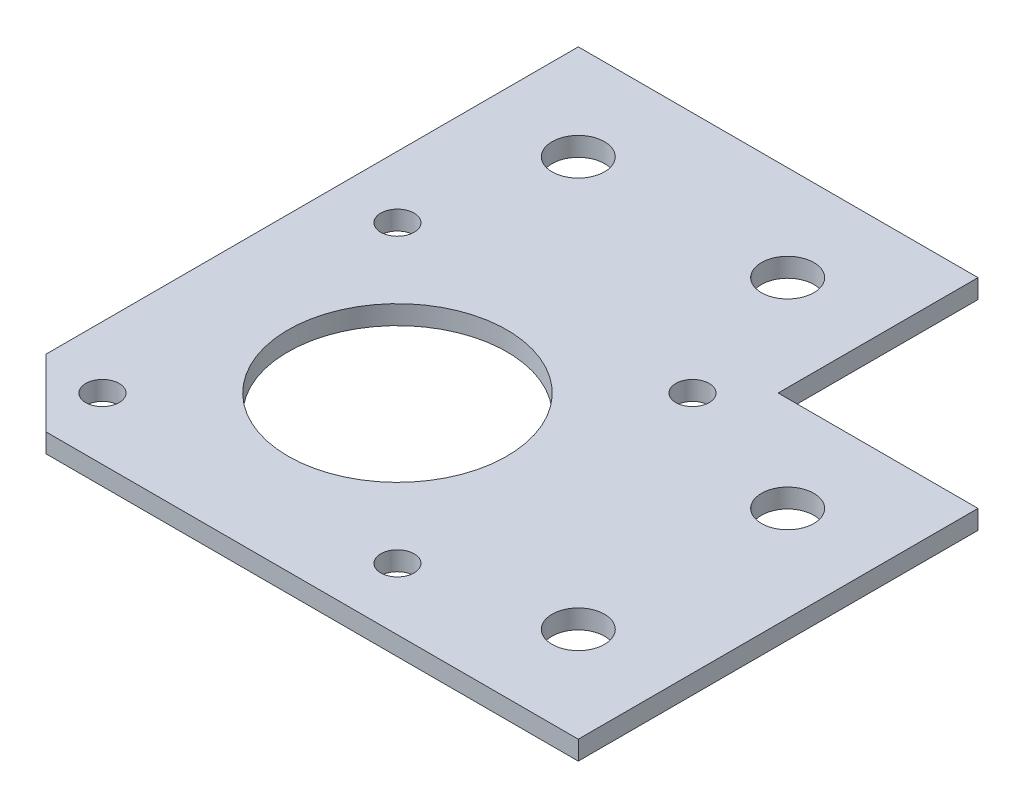
ISO-10303-21;
HEADER;
FILE_DESCRIPTION(('STEP AP214'),'2;1');
FILE_NAME('part.step','',(''),(''),'','','');
FILE_SCHEMA(('AUTOMOTIVE_DESIGN { 1 0 10303 214 1 1 1 1 }'));
ENDSEC;
DATA;
#1=APPLICATION_CONTEXT('core data for automotive mechanical design processes');
#2=APPLICATION_PROTOCOL_DEFINITION('international standard','automotive_design',2000,#1);
#3=PRODUCT_CONTEXT('',#1,'mechanical');
#4=PRODUCT('Part','Part','',(#3));
#5=PRODUCT_RELATED_PRODUCT_CATEGORY('part','',(#4));
#6=PRODUCT_DEFINITION_FORMATION('','',#4);
#7=PRODUCT_DEFINITION_CONTEXT('part definition',#1,'design');
#8=PRODUCT_DEFINITION('design','',#6,#7);
#9=PRODUCT_DEFINITION_SHAPE('','',#8);
#10=(LENGTH_UNIT() NAMED_UNIT(*) SI_UNIT(.MILLI.,.METRE.));
#11=(NAMED_UNIT(*) PLANE_ANGLE_UNIT() SI_UNIT($,.RADIAN.));
#12=(NAMED_UNIT(*) SI_UNIT($,.STERADIAN.) SOLID_ANGLE_UNIT());
#13=UNCERTAINTY_MEASURE_WITH_UNIT(LENGTH_MEASURE(1.E-05),#10,'distance_accuracy_value','');
#14=(GEOMETRIC_REPRESENTATION_CONTEXT(3) GLOBAL_UNCERTAINTY_ASSIGNED_CONTEXT((#13)) GLOBAL_UNIT_ASSIGNED_CONTEXT((#10,
#11,#12)) REPRESENTATION_CONTEXT('',''));
#15=CARTESIAN_POINT('',(0.,0.,0.));
#16=DIRECTION('',(0.,0.,1.));
#17=DIRECTION('',(1.,0.,0.));
#18=AXIS2_PLACEMENT_3D('',#15,#16,#17);
#19=CARTESIAN_POINT('',(-63.,2.,0.));
#20=DIRECTION('',(0.,0.,1.));
#21=DIRECTION('',(1.,0.,0.));
#22=AXIS2_PLACEMENT_3D('',#19,#20,#21);
#23=PLANE('',#22);
#24=DIRECTION('',(-1.,0.,0.));
#25=VECTOR('',#24,1.);
#26=CARTESIAN_POINT('',(-63.,0.,0.));
#27=LINE('',#26,#25);
#28=CARTESIAN_POINT('',(-21.,0.,0.));
#29=VERTEX_POINT('',#28);
#30=CARTESIAN_POINT('',(-63.,0.,0.));
#31=VERTEX_POINT('',#30);
#32=EDGE_CURVE('E125',#29,#31,#27,.T.);
#33=ORIENTED_EDGE('',*,*,#32,.T.);
#34=DIRECTION('',(0.,-1.,0.));
#35=VECTOR('',#34,1.);
#36=CARTESIAN_POINT('',(-63.,2.,0.));
#37=LINE('',#36,#35);
#38=CARTESIAN_POINT('',(-63.,2.,0.));
#39=VERTEX_POINT('',#38);
#40=EDGE_CURVE('E11',#39,#31,#37,.T.);
#41=ORIENTED_EDGE('',*,*,#40,.F.);
#42=DIRECTION('',(-1.,0.,0.));
#43=VECTOR('',#42,1.);
#44=CARTESIAN_POINT('',(-63.,2.,0.));
#45=LINE('',#44,#43);
#46=CARTESIAN_POINT('',(-21.,2.,0.));
#47=VERTEX_POINT('',#46);
#48=EDGE_CURVE('E138',#47,#39,#45,.T.);
#49=ORIENTED_EDGE('',*,*,#48,.F.);
#50=DIRECTION('',(0.,-1.,0.));
#51=VECTOR('',#50,1.);
#52=CARTESIAN_POINT('',(-21.,2.,0.));
#53=LINE('',#52,#51);
#54=EDGE_CURVE('E121',#47,#29,#53,.T.);
#55=ORIENTED_EDGE('',*,*,#54,.T.);
#56=EDGE_LOOP('',(#33,#41,#49,#55));
#57=FACE_BOUND('',#56,.T.);
#58=ADVANCED_FACE('F35',(#57),#23,.F.);
#59=CARTESIAN_POINT('',(-63.,2.,0.));
#60=DIRECTION('',(1.,0.,0.));
#61=DIRECTION('',(0.,0.,-1.));
#62=AXIS2_PLACEMENT_3D('',#59,#60,#61);
#63=PLANE('',#62);
#64=DIRECTION('',(0.,0.,1.));
#65=VECTOR('',#64,1.);
#66=CARTESIAN_POINT('',(-63.,0.,0.));
#67=LINE('',#66,#65);
#68=CARTESIAN_POINT('',(-63.,0.,55.9289321881345));
#69=VERTEX_POINT('',#68);
#70=EDGE_CURVE('E128',#31,#69,#67,.T.);
#71=ORIENTED_EDGE('',*,*,#70,.T.);
#72=DIRECTION('',(0.,1.,0.));
#73=VECTOR('',#72,1.);
#74=CARTESIAN_POINT('',(-63.,0.,55.9289321881345));
#75=LINE('',#74,#73);
#76=CARTESIAN_POINT('',(-63.,2.,55.9289321881345));
#77=VERTEX_POINT('',#76);
#78=EDGE_CURVE('E49',#69,#77,#75,.T.);
#79=ORIENTED_EDGE('',*,*,#78,.T.);
#80=DIRECTION('',(0.,0.,1.));
#81=VECTOR('',#80,1.);
#82=CARTESIAN_POINT('',(-63.,2.,0.));
#83=LINE('',#82,#81);
#84=EDGE_CURVE('E89',#39,#77,#83,.T.);
#85=ORIENTED_EDGE('',*,*,#84,.F.);
#86=ORIENTED_EDGE('',*,*,#40,.T.);
#87=EDGE_LOOP('',(#71,#79,#85,#86));
#88=FACE_BOUND('',#87,.T.);
#89=ADVANCED_FACE('F254',(#88),#63,.F.);
#90=CARTESIAN_POINT('',(-63.,2.,63.));
#91=DIRECTION('',(0.,0.,-1.));
#92=DIRECTION('',(-1.,0.,0.));
#93=AXIS2_PLACEMENT_3D('',#90,#91,#92);
#94=PLANE('',#93);
#95=DIRECTION('',(1.,0.,0.));
#96=VECTOR('',#95,1.);
#97=CARTESIAN_POINT('',(-63.,2.,63.));
#98=LINE('',#97,#96);
#99=CARTESIAN_POINT('',(-55.9289321881345,2.,63.));
#100=VERTEX_POINT('',#99);
#101=CARTESIAN_POINT('',(0.,2.,63.));
#102=VERTEX_POINT('',#101);
#103=EDGE_CURVE('E105',#100,#102,#98,.T.);
#104=ORIENTED_EDGE('',*,*,#103,.F.);
#105=DIRECTION('',(0.,1.,0.));
#106=VECTOR('',#105,1.);
#107=CARTESIAN_POINT('',(-55.9289321881345,0.,63.));
#108=LINE('',#107,#106);
#109=CARTESIAN_POINT('',(-55.9289321881345,0.,63.));
#110=VERTEX_POINT('',#109);
#111=EDGE_CURVE('E173',#110,#100,#108,.T.);
#112=ORIENTED_EDGE('',*,*,#111,.F.);
#113=DIRECTION('',(1.,0.,0.));
#114=VECTOR('',#113,1.);
#115=CARTESIAN_POINT('',(-63.,0.,63.));
#116=LINE('',#115,#114);
#117=CARTESIAN_POINT('',(0.,0.,63.));
#118=VERTEX_POINT('',#117);
#119=EDGE_CURVE('E132',#110,#118,#116,.T.);
#120=ORIENTED_EDGE('',*,*,#119,.T.);
#121=DIRECTION('',(0.,-1.,0.));
#122=VECTOR('',#121,1.);
#123=CARTESIAN_POINT('',(0.,2.,63.));
#124=LINE('',#123,#122);
#125=EDGE_CURVE('E42',#102,#118,#124,.T.);
#126=ORIENTED_EDGE('',*,*,#125,.F.);
#127=EDGE_LOOP('',(#104,#112,#120,#126));
#128=FACE_BOUND('',#127,.T.);
#129=ADVANCED_FACE('F258',(#128),#94,.F.);
#130=CARTESIAN_POINT('',(0.,2.,63.));
#131=DIRECTION('',(-1.,0.,0.));
#132=DIRECTION('',(0.,0.,1.));
#133=AXIS2_PLACEMENT_3D('',#130,#131,#132);
#134=PLANE('',#133);
#135=DIRECTION('',(0.,0.,-1.));
#136=VECTOR('',#135,1.);
#137=CARTESIAN_POINT('',(0.,0.,63.));
#138=LINE('',#137,#136);
#139=CARTESIAN_POINT('',(0.,0.,21.));
#140=VERTEX_POINT('',#139);
#141=EDGE_CURVE('E114',#118,#140,#138,.T.);
#142=ORIENTED_EDGE('',*,*,#141,.T.);
#143=DIRECTION('',(0.,-1.,0.));
#144=VECTOR('',#143,1.);
#145=CARTESIAN_POINT('',(0.,2.,21.));
#146=LINE('',#145,#144);
#147=CARTESIAN_POINT('',(0.,2.,21.));
#148=VERTEX_POINT('',#147);
#149=EDGE_CURVE('E111',#148,#140,#146,.T.);
#150=ORIENTED_EDGE('',*,*,#149,.F.);
#151=DIRECTION('',(0.,0.,-1.));
#152=VECTOR('',#151,1.);
#153=CARTESIAN_POINT('',(0.,2.,63.));
#154=LINE('',#153,#152);
#155=EDGE_CURVE('E97',#102,#148,#154,.T.);
#156=ORIENTED_EDGE('',*,*,#155,.F.);
#157=ORIENTED_EDGE('',*,*,#125,.T.);
#158=EDGE_LOOP('',(#142,#150,#156,#157));
#159=FACE_BOUND('',#158,.T.);
#160=ADVANCED_FACE('F112',(#159),#134,.F.);
#161=CARTESIAN_POINT('',(-21.,2.,21.));
#162=DIRECTION('',(0.,0.,1.));
#163=DIRECTION('',(1.,0.,0.));
#164=AXIS2_PLACEMENT_3D('',#161,#162,#163);
#165=PLANE('',#164);
#166=DIRECTION('',(-1.,0.,0.));
#167=VECTOR('',#166,1.);
#168=CARTESIAN_POINT('',(-21.,0.,21.));
#169=LINE('',#168,#167);
#170=CARTESIAN_POINT('',(-21.,0.,21.));
#171=VERTEX_POINT('',#170);
#172=EDGE_CURVE('E135',#140,#171,#169,.T.);
#173=ORIENTED_EDGE('',*,*,#172,.T.);
#174=DIRECTION('',(0.,-1.,0.));
#175=VECTOR('',#174,1.);
#176=CARTESIAN_POINT('',(-21.,2.,21.));
#177=LINE('',#176,#175);
#178=CARTESIAN_POINT('',(-21.,2.,21.));
#179=VERTEX_POINT('',#178);
#180=EDGE_CURVE('E117',#179,#171,#177,.T.);
#181=ORIENTED_EDGE('',*,*,#180,.F.);
#182=DIRECTION('',(-1.,0.,0.));
#183=VECTOR('',#182,1.);
#184=CARTESIAN_POINT('',(-21.,2.,21.));
#185=LINE('',#184,#183);
#186=EDGE_CURVE('E101',#148,#179,#185,.T.);
#187=ORIENTED_EDGE('',*,*,#186,.F.);
#188=ORIENTED_EDGE('',*,*,#149,.T.);
#189=EDGE_LOOP('',(#173,#181,#187,#188));
#190=FACE_BOUND('',#189,.T.);
#191=ADVANCED_FACE('F119',(#190),#165,.F.);
#192=CARTESIAN_POINT('',(-21.,2.,0.));
#193=DIRECTION('',(-1.,0.,0.));
#194=DIRECTION('',(0.,0.,1.));
#195=AXIS2_PLACEMENT_3D('',#192,#193,#194);
#196=PLANE('',#195);
#197=DIRECTION('',(0.,0.,-1.));
#198=VECTOR('',#197,1.);
#199=CARTESIAN_POINT('',(-21.,0.,0.));
#200=LINE('',#199,#198);
#201=EDGE_CURVE('E82',#171,#29,#200,.T.);
#202=ORIENTED_EDGE('',*,*,#201,.T.);
#203=ORIENTED_EDGE('',*,*,#54,.F.);
#204=DIRECTION('',(0.,0.,-1.));
#205=VECTOR('',#204,1.);
#206=CARTESIAN_POINT('',(-21.,2.,0.));
#207=LINE('',#206,#205);
#208=EDGE_CURVE('E58',#179,#47,#207,.T.);
#209=ORIENTED_EDGE('',*,*,#208,.F.);
#210=ORIENTED_EDGE('',*,*,#180,.T.);
#211=EDGE_LOOP('',(#202,#203,#209,#210));
#212=FACE_BOUND('',#211,.T.);
#213=ADVANCED_FACE('F146',(#212),#196,.F.);
#214=CARTESIAN_POINT('',(0.,2.,0.));
#215=DIRECTION('',(0.,-1.,0.));
#216=DIRECTION('',(0.,0.,-1.));
#217=AXIS2_PLACEMENT_3D('',#214,#215,#216);
#218=PLANE('',#217);
#219=CARTESIAN_POINT('',(-31.,2.,10.));
#220=DIRECTION('',(0.,1.,0.));
#221=DIRECTION('',(0.,0.,1.));
#222=AXIS2_PLACEMENT_3D('',#219,#220,#221);
#223=CIRCLE('',#222,2.75);
#224=CARTESIAN_POINT('',(-31.,2.,12.75));
#225=VERTEX_POINT('',#224);
#226=EDGE_CURVE('E159',#225,#225,#223,.T.);
#227=ORIENTED_EDGE('',*,*,#226,.F.);
#228=EDGE_LOOP('',(#227));
#229=FACE_BOUND('',#228,.T.);
#230=CARTESIAN_POINT('',(-9.99999999999999,2.,53.));
#231=DIRECTION('',(0.,1.,0.));
#232=DIRECTION('',(0.,0.,1.));
#233=AXIS2_PLACEMENT_3D('',#230,#231,#232);
#234=CIRCLE('',#233,2.75);
#235=CARTESIAN_POINT('',(-9.99999999999999,2.,55.75));
#236=VERTEX_POINT('',#235);
#237=EDGE_CURVE('E187',#236,#236,#234,.T.);
#238=ORIENTED_EDGE('',*,*,#237,.F.);
#239=EDGE_LOOP('',(#238));
#240=FACE_BOUND('',#239,.T.);
#241=CARTESIAN_POINT('',(-10.,2.,31.));
#242=DIRECTION('',(0.,1.,0.));
#243=DIRECTION('',(0.,0.,1.));
#244=AXIS2_PLACEMENT_3D('',#241,#242,#243);
#245=CIRCLE('',#244,2.75);
#246=CARTESIAN_POINT('',(-10.,2.,33.75));
#247=VERTEX_POINT('',#246);
#248=EDGE_CURVE('E172',#247,#247,#245,.T.);
#249=ORIENTED_EDGE('',*,*,#248,.F.);
#250=EDGE_LOOP('',(#249));
#251=FACE_BOUND('',#250,.T.);
#252=CARTESIAN_POINT('',(-56.5,2.,56.5));
#253=DIRECTION('',(0.,1.,0.));
#254=DIRECTION('',(0.,0.,1.));
#255=AXIS2_PLACEMENT_3D('',#252,#253,#254);
#256=CIRCLE('',#255,1.75);
#257=CARTESIAN_POINT('',(-56.5,2.,58.25));
#258=VERTEX_POINT('',#257);
#259=EDGE_CURVE('E166',#258,#258,#256,.T.);
#260=ORIENTED_EDGE('',*,*,#259,.F.);
#261=EDGE_LOOP('',(#260));
#262=FACE_BOUND('',#261,.T.);
#263=CARTESIAN_POINT('',(-25.5,2.,56.5));
#264=DIRECTION('',(0.,1.,0.));
#265=DIRECTION('',(0.,0.,1.));
#266=AXIS2_PLACEMENT_3D('',#263,#264,#265);
#267=CIRCLE('',#266,1.75);
#268=CARTESIAN_POINT('',(-25.5,2.,58.25));
#269=VERTEX_POINT('',#268);
#270=EDGE_CURVE('E209',#269,#269,#267,.T.);
#271=ORIENTED_EDGE('',*,*,#270,.F.);
#272=EDGE_LOOP('',(#271));
#273=FACE_BOUND('',#272,.T.);
#274=CARTESIAN_POINT('',(-25.5000000000001,2.,25.5));
#275=DIRECTION('',(0.,1.,0.));
#276=DIRECTION('',(0.,0.,1.));
#277=AXIS2_PLACEMENT_3D('',#274,#275,#276);
#278=CIRCLE('',#277,1.75);
#279=CARTESIAN_POINT('',(-25.5000000000001,2.,27.25));
#280=VERTEX_POINT('',#279);
#281=EDGE_CURVE('E203',#280,#280,#278,.T.);
#282=ORIENTED_EDGE('',*,*,#281,.F.);
#283=EDGE_LOOP('',(#282));
#284=FACE_BOUND('',#283,.T.);
#285=CARTESIAN_POINT('',(-56.5000000000001,2.,25.5));
#286=DIRECTION('',(0.,1.,0.));
#287=DIRECTION('',(0.,0.,1.));
#288=AXIS2_PLACEMENT_3D('',#285,#286,#287);
#289=CIRCLE('',#288,1.75);
#290=CARTESIAN_POINT('',(-56.5000000000001,2.,27.25));
#291=VERTEX_POINT('',#290);
#292=EDGE_CURVE('E197',#291,#291,#289,.T.);
#293=ORIENTED_EDGE('',*,*,#292,.F.);
#294=EDGE_LOOP('',(#293));
#295=FACE_BOUND('',#294,.T.);
#296=CARTESIAN_POINT('',(-41.,2.,41.));
#297=DIRECTION('',(0.,1.,0.));
#298=DIRECTION('',(0.,0.,1.));
#299=AXIS2_PLACEMENT_3D('',#296,#297,#298);
#300=CIRCLE('',#299,11.5);
#301=CARTESIAN_POINT('',(-41.,2.,52.5));
#302=VERTEX_POINT('',#301);
#303=EDGE_CURVE('E165',#302,#302,#300,.T.);
#304=ORIENTED_EDGE('',*,*,#303,.F.);
#305=EDGE_LOOP('',(#304));
#306=FACE_BOUND('',#305,.T.);
#307=CARTESIAN_POINT('',(-53.,2.,10.));
#308=DIRECTION('',(0.,1.,0.));
#309=DIRECTION('',(0.,0.,1.));
#310=AXIS2_PLACEMENT_3D('',#307,#308,#309);
#311=CIRCLE('',#310,2.75000000000001);
#312=CARTESIAN_POINT('',(-53.,2.,12.75));
#313=VERTEX_POINT('',#312);
#314=EDGE_CURVE('E153',#313,#313,#311,.T.);
#315=ORIENTED_EDGE('',*,*,#314,.F.);
#316=EDGE_LOOP('',(#315));
#317=FACE_BOUND('',#316,.T.);
#318=ORIENTED_EDGE('',*,*,#84,.T.);
#319=DIRECTION('',(-0.707106781186546,0.,-0.707106781186549));
#320=VECTOR('',#319,1.);
#321=CARTESIAN_POINT('',(-63.,2.,55.9289321881345));
#322=LINE('',#321,#320);
#323=EDGE_CURVE('E178',#100,#77,#322,.T.);
#324=ORIENTED_EDGE('',*,*,#323,.F.);
#325=ORIENTED_EDGE('',*,*,#103,.T.);
#326=ORIENTED_EDGE('',*,*,#155,.T.);
#327=ORIENTED_EDGE('',*,*,#186,.T.);
#328=ORIENTED_EDGE('',*,*,#208,.T.);
#329=ORIENTED_EDGE('',*,*,#48,.T.);
#330=EDGE_LOOP('',(#318,#324,#325,#326,#327,#328,#329));
#331=FACE_BOUND('',#330,.T.);
#332=ADVANCED_FACE('F99',(#229,#240,#251,#262,#273,#284,#295,#306,#317,#331),#218,.F.);
#333=CARTESIAN_POINT('',(0.,0.,0.));
#334=DIRECTION('',(0.,-1.,0.));
#335=DIRECTION('',(0.,0.,-1.));
#336=AXIS2_PLACEMENT_3D('',#333,#334,#335);
#337=PLANE('',#336);
#338=CARTESIAN_POINT('',(-31.,0.,10.));
#339=DIRECTION('',(0.,1.,0.));
#340=DIRECTION('',(0.,0.,1.));
#341=AXIS2_PLACEMENT_3D('',#338,#339,#340);
#342=CIRCLE('',#341,2.75);
#343=CARTESIAN_POINT('',(-31.,0.,12.75));
#344=VERTEX_POINT('',#343);
#345=EDGE_CURVE('E162',#344,#344,#342,.T.);
#346=ORIENTED_EDGE('',*,*,#345,.T.);
#347=EDGE_LOOP('',(#346));
#348=FACE_BOUND('',#347,.T.);
#349=CARTESIAN_POINT('',(-9.99999999999999,0.,53.));
#350=DIRECTION('',(0.,1.,0.));
#351=DIRECTION('',(0.,0.,1.));
#352=AXIS2_PLACEMENT_3D('',#349,#350,#351);
#353=CIRCLE('',#352,2.75);
#354=CARTESIAN_POINT('',(-9.99999999999999,0.,55.75));
#355=VERTEX_POINT('',#354);
#356=EDGE_CURVE('E156',#355,#355,#353,.T.);
#357=ORIENTED_EDGE('',*,*,#356,.T.);
#358=EDGE_LOOP('',(#357));
#359=FACE_BOUND('',#358,.T.);
#360=CARTESIAN_POINT('',(-10.,0.,31.));
#361=DIRECTION('',(0.,1.,0.));
#362=DIRECTION('',(0.,0.,1.));
#363=AXIS2_PLACEMENT_3D('',#360,#361,#362);
#364=CIRCLE('',#363,2.75);
#365=CARTESIAN_POINT('',(-10.,0.,33.75));
#366=VERTEX_POINT('',#365);
#367=EDGE_CURVE('E184',#366,#366,#364,.T.);
#368=ORIENTED_EDGE('',*,*,#367,.T.);
#369=EDGE_LOOP('',(#368));
#370=FACE_BOUND('',#369,.T.);
#371=DIRECTION('',(-0.707106781186546,0.,-0.707106781186549));
#372=VECTOR('',#371,1.);
#373=CARTESIAN_POINT('',(-63.,0.,55.9289321881345));
#374=LINE('',#373,#372);
#375=EDGE_CURVE('E176',#110,#69,#374,.T.);
#376=ORIENTED_EDGE('',*,*,#375,.T.);
#377=ORIENTED_EDGE('',*,*,#70,.F.);
#378=ORIENTED_EDGE('',*,*,#32,.F.);
#379=ORIENTED_EDGE('',*,*,#201,.F.);
#380=ORIENTED_EDGE('',*,*,#172,.F.);
#381=ORIENTED_EDGE('',*,*,#141,.F.);
#382=ORIENTED_EDGE('',*,*,#119,.F.);
#383=EDGE_LOOP('',(#376,#377,#378,#379,#380,#381,#382));
#384=FACE_BOUND('',#383,.T.);
#385=CARTESIAN_POINT('',(-56.5,0.,56.5));
#386=DIRECTION('',(0.,1.,0.));
#387=DIRECTION('',(0.,0.,1.));
#388=AXIS2_PLACEMENT_3D('',#385,#386,#387);
#389=CIRCLE('',#388,1.75);
#390=CARTESIAN_POINT('',(-56.5,0.,58.25));
#391=VERTEX_POINT('',#390);
#392=EDGE_CURVE('E169',#391,#391,#389,.T.);
#393=ORIENTED_EDGE('',*,*,#392,.T.);
#394=EDGE_LOOP('',(#393));
#395=FACE_BOUND('',#394,.T.);
#396=CARTESIAN_POINT('',(-25.5,0.,56.5));
#397=DIRECTION('',(0.,1.,0.));
#398=DIRECTION('',(0.,0.,1.));
#399=AXIS2_PLACEMENT_3D('',#396,#397,#398);
#400=CIRCLE('',#399,1.75);
#401=CARTESIAN_POINT('',(-25.5,0.,58.25));
#402=VERTEX_POINT('',#401);
#403=EDGE_CURVE('E180',#402,#402,#400,.T.);
#404=ORIENTED_EDGE('',*,*,#403,.T.);
#405=EDGE_LOOP('',(#404));
#406=FACE_BOUND('',#405,.T.);
#407=CARTESIAN_POINT('',(-25.5000000000001,0.,25.5));
#408=DIRECTION('',(0.,1.,0.));
#409=DIRECTION('',(0.,0.,1.));
#410=AXIS2_PLACEMENT_3D('',#407,#408,#409);
#411=CIRCLE('',#410,1.75);
#412=CARTESIAN_POINT('',(-25.5000000000001,0.,27.25));
#413=VERTEX_POINT('',#412);
#414=EDGE_CURVE('E206',#413,#413,#411,.T.);
#415=ORIENTED_EDGE('',*,*,#414,.T.);
#416=EDGE_LOOP('',(#415));
#417=FACE_BOUND('',#416,.T.);
#418=CARTESIAN_POINT('',(-56.5000000000001,0.,25.5));
#419=DIRECTION('',(0.,1.,0.));
#420=DIRECTION('',(0.,0.,1.));
#421=AXIS2_PLACEMENT_3D('',#418,#419,#420);
#422=CIRCLE('',#421,1.75);
#423=CARTESIAN_POINT('',(-56.5000000000001,0.,27.25));
#424=VERTEX_POINT('',#423);
#425=EDGE_CURVE('E200',#424,#424,#422,.T.);
#426=ORIENTED_EDGE('',*,*,#425,.T.);
#427=EDGE_LOOP('',(#426));
#428=FACE_BOUND('',#427,.T.);
#429=CARTESIAN_POINT('',(-41.,0.,41.));
#430=DIRECTION('',(0.,1.,0.));
#431=DIRECTION('',(0.,0.,1.));
#432=AXIS2_PLACEMENT_3D('',#429,#430,#431);
#433=CIRCLE('',#432,11.5);
#434=CARTESIAN_POINT('',(-41.,0.,52.5));
#435=VERTEX_POINT('',#434);
#436=EDGE_CURVE('E194',#435,#435,#433,.T.);
#437=ORIENTED_EDGE('',*,*,#436,.T.);
#438=EDGE_LOOP('',(#437));
#439=FACE_BOUND('',#438,.T.);
#440=CARTESIAN_POINT('',(-53.,0.,10.));
#441=DIRECTION('',(0.,1.,0.));
#442=DIRECTION('',(0.,0.,1.));
#443=AXIS2_PLACEMENT_3D('',#440,#441,#442);
#444=CIRCLE('',#443,2.75000000000001);
#445=CARTESIAN_POINT('',(-53.,0.,12.75));
#446=VERTEX_POINT('',#445);
#447=EDGE_CURVE('E129',#446,#446,#444,.T.);
#448=ORIENTED_EDGE('',*,*,#447,.T.);
#449=EDGE_LOOP('',(#448));
#450=FACE_BOUND('',#449,.T.);
#451=ADVANCED_FACE('F143',(#348,#359,#370,#384,#395,#406,#417,#428,#439,#450),#337,.T.);
#452=CARTESIAN_POINT('',(-53.,0.,10.));
#453=DIRECTION('',(0.,1.,0.));
#454=DIRECTION('',(0.,0.,1.));
#455=AXIS2_PLACEMENT_3D('',#452,#453,#454);
#456=CYLINDRICAL_SURFACE('',#455,2.75000000000001);
#457=ORIENTED_EDGE('',*,*,#447,.F.);
#458=EDGE_LOOP('',(#457));
#459=FACE_BOUND('',#458,.T.);
#460=ORIENTED_EDGE('',*,*,#314,.T.);
#461=EDGE_LOOP('',(#460));
#462=FACE_BOUND('',#461,.T.);
#463=ADVANCED_FACE('F237',(#459,#462),#456,.F.);
#464=CARTESIAN_POINT('',(-41.,0.,41.));
#465=DIRECTION('',(0.,1.,0.));
#466=DIRECTION('',(0.,0.,1.));
#467=AXIS2_PLACEMENT_3D('',#464,#465,#466);
#468=CYLINDRICAL_SURFACE('',#467,11.5);
#469=ORIENTED_EDGE('',*,*,#436,.F.);
#470=EDGE_LOOP('',(#469));
#471=FACE_BOUND('',#470,.T.);
#472=ORIENTED_EDGE('',*,*,#303,.T.);
#473=EDGE_LOOP('',(#472));
#474=FACE_BOUND('',#473,.T.);
#475=ADVANCED_FACE('F239',(#471,#474),#468,.F.);
#476=CARTESIAN_POINT('',(-56.5000000000001,0.,25.5));
#477=DIRECTION('',(0.,1.,0.));
#478=DIRECTION('',(0.,0.,1.));
#479=AXIS2_PLACEMENT_3D('',#476,#477,#478);
#480=CYLINDRICAL_SURFACE('',#479,1.75);
#481=ORIENTED_EDGE('',*,*,#425,.F.);
#482=EDGE_LOOP('',(#481));
#483=FACE_BOUND('',#482,.T.);
#484=ORIENTED_EDGE('',*,*,#292,.T.);
#485=EDGE_LOOP('',(#484));
#486=FACE_BOUND('',#485,.T.);
#487=ADVANCED_FACE('F246',(#483,#486),#480,.F.);
#488=CARTESIAN_POINT('',(-25.5000000000001,0.,25.5));
#489=DIRECTION('',(0.,1.,0.));
#490=DIRECTION('',(0.,0.,1.));
#491=AXIS2_PLACEMENT_3D('',#488,#489,#490);
#492=CYLINDRICAL_SURFACE('',#491,1.75);
#493=ORIENTED_EDGE('',*,*,#414,.F.);
#494=EDGE_LOOP('',(#493));
#495=FACE_BOUND('',#494,.T.);
#496=ORIENTED_EDGE('',*,*,#281,.T.);
#497=EDGE_LOOP('',(#496));
#498=FACE_BOUND('',#497,.T.);
#499=ADVANCED_FACE('F221',(#495,#498),#492,.F.);
#500=CARTESIAN_POINT('',(-25.5,0.,56.5));
#501=DIRECTION('',(0.,1.,0.));
#502=DIRECTION('',(0.,0.,1.));
#503=AXIS2_PLACEMENT_3D('',#500,#501,#502);
#504=CYLINDRICAL_SURFACE('',#503,1.75);
#505=ORIENTED_EDGE('',*,*,#403,.F.);
#506=EDGE_LOOP('',(#505));
#507=FACE_BOUND('',#506,.T.);
#508=ORIENTED_EDGE('',*,*,#270,.T.);
#509=EDGE_LOOP('',(#508));
#510=FACE_BOUND('',#509,.T.);
#511=ADVANCED_FACE('F217',(#507,#510),#504,.F.);
#512=CARTESIAN_POINT('',(-56.5,0.,56.5));
#513=DIRECTION('',(0.,1.,0.));
#514=DIRECTION('',(0.,0.,1.));
#515=AXIS2_PLACEMENT_3D('',#512,#513,#514);
#516=CYLINDRICAL_SURFACE('',#515,1.75);
#517=ORIENTED_EDGE('',*,*,#392,.F.);
#518=EDGE_LOOP('',(#517));
#519=FACE_BOUND('',#518,.T.);
#520=ORIENTED_EDGE('',*,*,#259,.T.);
#521=EDGE_LOOP('',(#520));
#522=FACE_BOUND('',#521,.T.);
#523=ADVANCED_FACE('F220',(#519,#522),#516,.F.);
#524=CARTESIAN_POINT('',(-63.,0.,55.9289321881345));
#525=DIRECTION('',(0.707106781186549,0.,-0.707106781186546));
#526=DIRECTION('',(-0.707106781186546,0.,-0.707106781186549));
#527=AXIS2_PLACEMENT_3D('',#524,#525,#526);
#528=PLANE('',#527);
#529=ORIENTED_EDGE('',*,*,#323,.T.);
#530=ORIENTED_EDGE('',*,*,#78,.F.);
#531=ORIENTED_EDGE('',*,*,#375,.F.);
#532=ORIENTED_EDGE('',*,*,#111,.T.);
#533=EDGE_LOOP('',(#529,#530,#531,#532));
#534=FACE_BOUND('',#533,.T.);
#535=ADVANCED_FACE('F325',(#534),#528,.F.);
#536=CARTESIAN_POINT('',(-10.,0.,31.));
#537=DIRECTION('',(0.,1.,0.));
#538=DIRECTION('',(0.,0.,1.));
#539=AXIS2_PLACEMENT_3D('',#536,#537,#538);
#540=CYLINDRICAL_SURFACE('',#539,2.75);
#541=ORIENTED_EDGE('',*,*,#367,.F.);
#542=EDGE_LOOP('',(#541));
#543=FACE_BOUND('',#542,.T.);
#544=ORIENTED_EDGE('',*,*,#248,.T.);
#545=EDGE_LOOP('',(#544));
#546=FACE_BOUND('',#545,.T.);
#547=ADVANCED_FACE('F335',(#543,#546),#540,.F.);
#548=CARTESIAN_POINT('',(-9.99999999999999,0.,53.));
#549=DIRECTION('',(0.,1.,0.));
#550=DIRECTION('',(0.,0.,1.));
#551=AXIS2_PLACEMENT_3D('',#548,#549,#550);
#552=CYLINDRICAL_SURFACE('',#551,2.75);
#553=ORIENTED_EDGE('',*,*,#356,.F.);
#554=EDGE_LOOP('',(#553));
#555=FACE_BOUND('',#554,.T.);
#556=ORIENTED_EDGE('',*,*,#237,.T.);
#557=EDGE_LOOP('',(#556));
#558=FACE_BOUND('',#557,.T.);
#559=ADVANCED_FACE('F344',(#555,#558),#552,.F.);
#560=CARTESIAN_POINT('',(-31.,0.,10.));
#561=DIRECTION('',(0.,1.,0.));
#562=DIRECTION('',(0.,0.,1.));
#563=AXIS2_PLACEMENT_3D('',#560,#561,#562);
#564=CYLINDRICAL_SURFACE('',#563,2.75);
#565=ORIENTED_EDGE('',*,*,#345,.F.);
#566=EDGE_LOOP('',(#565));
#567=FACE_BOUND('',#566,.T.);
#568=ORIENTED_EDGE('',*,*,#226,.T.);
#569=EDGE_LOOP('',(#568));
#570=FACE_BOUND('',#569,.T.);
#571=ADVANCED_FACE('F354',(#567,#570),#564,.F.);
#572=CLOSED_SHELL('',(#58,#89,#129,#160,#191,#213,#332,#451,#463,#475,#487,#499,#511,#523,#535,
#547,#559,#571));
#573=MANIFOLD_SOLID_BREP('B2',#572);
#574=ADVANCED_BREP_SHAPE_REPRESENTATION('',(#18,#573),#14);
#575=SHAPE_DEFINITION_REPRESENTATION(#9,#574);
ENDSEC;
END-ISO-10303-21;
